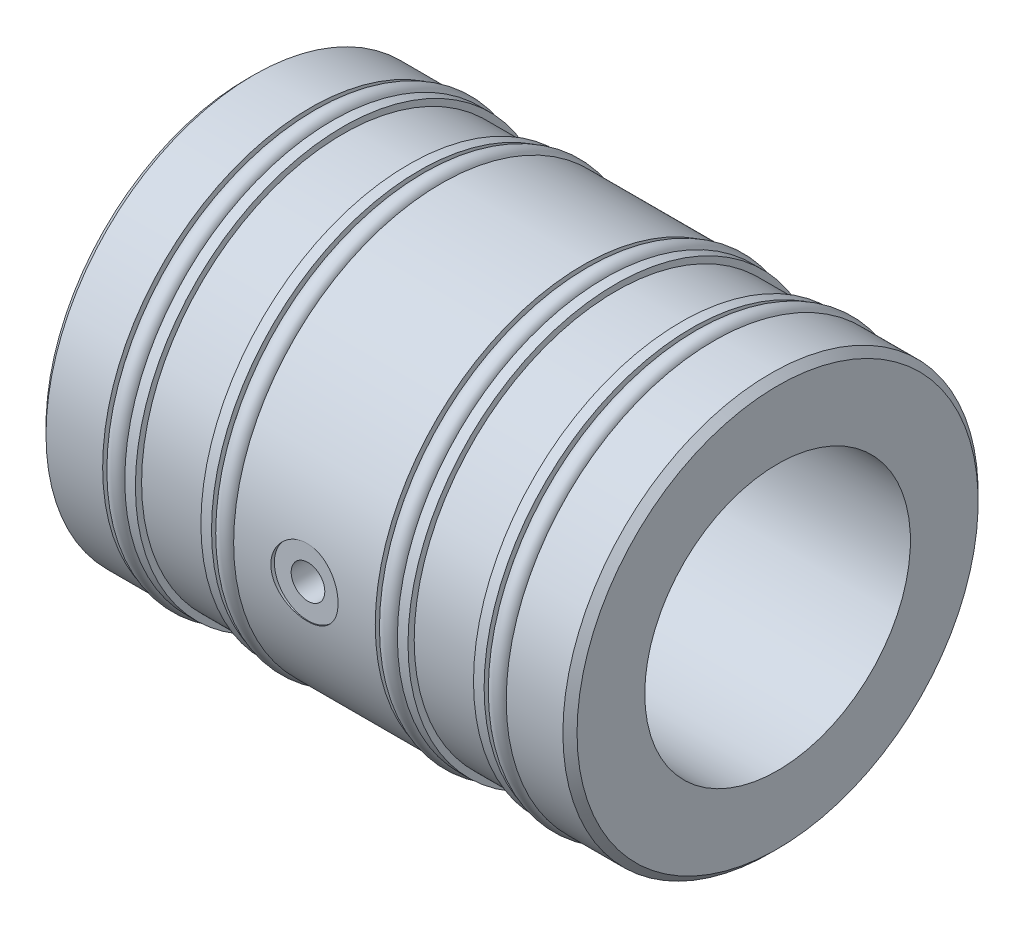
ISO-10303-21;
HEADER;
FILE_DESCRIPTION(('STEP AP214'),'2;1');
FILE_NAME('part.step','',(''),(''),'','','');
FILE_SCHEMA(('AUTOMOTIVE_DESIGN { 1 0 10303 214 1 1 1 1 }'));
ENDSEC;
DATA;
#1=APPLICATION_CONTEXT('core data for automotive mechanical design processes');
#2=APPLICATION_PROTOCOL_DEFINITION('international standard','automotive_design',2000,#1);
#3=PRODUCT_CONTEXT('',#1,'mechanical');
#4=PRODUCT('Part','Part','',(#3));
#5=PRODUCT_RELATED_PRODUCT_CATEGORY('part','',(#4));
#6=PRODUCT_DEFINITION_FORMATION('','',#4);
#7=PRODUCT_DEFINITION_CONTEXT('part definition',#1,'design');
#8=PRODUCT_DEFINITION('design','',#6,#7);
#9=PRODUCT_DEFINITION_SHAPE('','',#8);
#10=(LENGTH_UNIT() NAMED_UNIT(*) SI_UNIT(.MILLI.,.METRE.));
#11=(NAMED_UNIT(*) PLANE_ANGLE_UNIT() SI_UNIT($,.RADIAN.));
#12=(NAMED_UNIT(*) SI_UNIT($,.STERADIAN.) SOLID_ANGLE_UNIT());
#13=UNCERTAINTY_MEASURE_WITH_UNIT(LENGTH_MEASURE(1.E-05),#10,'distance_accuracy_value','');
#14=(GEOMETRIC_REPRESENTATION_CONTEXT(3) GLOBAL_UNCERTAINTY_ASSIGNED_CONTEXT((#13)) GLOBAL_UNIT_ASSIGNED_CONTEXT((#10,
#11,#12)) REPRESENTATION_CONTEXT('',''));
#15=CARTESIAN_POINT('',(0.,0.,0.));
#16=DIRECTION('',(0.,0.,1.));
#17=DIRECTION('',(1.,0.,0.));
#18=AXIS2_PLACEMENT_3D('',#15,#16,#17);
#19=CARTESIAN_POINT('',(0.,0.,0.));
#20=DIRECTION('',(-1.,0.,0.));
#21=DIRECTION('',(0.,0.,1.));
#22=AXIS2_PLACEMENT_3D('',#19,#20,#21);
#23=CYLINDRICAL_SURFACE('',#22,27.813);
#24=CARTESIAN_POINT('',(63.881,0.,0.));
#25=DIRECTION('',(-1.,0.,0.));
#26=DIRECTION('',(0.,0.,1.));
#27=AXIS2_PLACEMENT_3D('',#24,#25,#26);
#28=CIRCLE('',#27,27.813);
#29=CARTESIAN_POINT('',(63.881,0.,27.813));
#30=VERTEX_POINT('',#29);
#31=EDGE_CURVE('E93',#30,#30,#28,.T.);
#32=ORIENTED_EDGE('',*,*,#31,.F.);
#33=EDGE_LOOP('',(#32));
#34=FACE_BOUND('',#33,.T.);
#35=CARTESIAN_POINT('',(64.7887236764935,0.,0.));
#36=DIRECTION('',(1.,0.,0.));
#37=DIRECTION('',(0.,0.,-1.));
#38=AXIS2_PLACEMENT_3D('',#35,#36,#37);
#39=CIRCLE('',#38,27.813);
#40=CARTESIAN_POINT('',(64.7887236764935,0.,-27.813));
#41=VERTEX_POINT('',#40);
#42=EDGE_CURVE('E12',#41,#41,#39,.T.);
#43=ORIENTED_EDGE('',*,*,#42,.F.);
#44=EDGE_LOOP('',(#43));
#45=FACE_BOUND('',#44,.T.);
#46=ADVANCED_FACE('F36',(#34,#45),#23,.T.);
#47=CARTESIAN_POINT('',(67.056,0.,0.));
#48=DIRECTION('',(-1.,0.,0.));
#49=DIRECTION('',(0.,0.,1.));
#50=AXIS2_PLACEMENT_3D('',#47,#48,#49);
#51=CIRCLE('',#50,27.813);
#52=CARTESIAN_POINT('',(67.056,0.,27.813));
#53=VERTEX_POINT('',#52);
#54=EDGE_CURVE('E90',#53,#53,#51,.T.);
#55=ORIENTED_EDGE('',*,*,#54,.T.);
#56=EDGE_LOOP('',(#55));
#57=FACE_BOUND('',#56,.T.);
#58=CARTESIAN_POINT('',(66.1482763235065,0.,0.));
#59=DIRECTION('',(-1.,0.,0.));
#60=DIRECTION('',(0.,0.,1.));
#61=AXIS2_PLACEMENT_3D('',#58,#59,#60);
#62=CIRCLE('',#61,27.813);
#63=CARTESIAN_POINT('',(66.1482763235065,0.,27.813));
#64=VERTEX_POINT('',#63);
#65=EDGE_CURVE('E44',#64,#64,#62,.T.);
#66=ORIENTED_EDGE('',*,*,#65,.F.);
#67=EDGE_LOOP('',(#66));
#68=FACE_BOUND('',#67,.T.);
#69=ADVANCED_FACE('F210',(#57,#68),#23,.T.);
#70=CARTESIAN_POINT('',(0.,0.,0.));
#71=DIRECTION('',(-1.,0.,0.));
#72=DIRECTION('',(0.,0.,1.));
#73=AXIS2_PLACEMENT_3D('',#70,#71,#72);
#74=CYLINDRICAL_SURFACE('',#73,27.813);
#75=CARTESIAN_POINT('',(48.26,0.,0.));
#76=DIRECTION('',(-1.,0.,0.));
#77=DIRECTION('',(0.,0.,1.));
#78=AXIS2_PLACEMENT_3D('',#75,#76,#77);
#79=CIRCLE('',#78,27.813);
#80=CARTESIAN_POINT('',(48.26,0.,27.813));
#81=VERTEX_POINT('',#80);
#82=EDGE_CURVE('E117',#81,#81,#79,.T.);
#83=ORIENTED_EDGE('',*,*,#82,.F.);
#84=EDGE_LOOP('',(#83));
#85=FACE_BOUND('',#84,.T.);
#86=CARTESIAN_POINT('',(49.1677236764935,0.,0.));
#87=DIRECTION('',(1.,0.,0.));
#88=DIRECTION('',(0.,0.,-1.));
#89=AXIS2_PLACEMENT_3D('',#86,#87,#88);
#90=CIRCLE('',#89,27.813);
#91=CARTESIAN_POINT('',(49.1677236764935,0.,-27.813));
#92=VERTEX_POINT('',#91);
#93=EDGE_CURVE('E257',#92,#92,#90,.T.);
#94=ORIENTED_EDGE('',*,*,#93,.F.);
#95=EDGE_LOOP('',(#94));
#96=FACE_BOUND('',#95,.T.);
#97=ADVANCED_FACE('F240',(#85,#96),#74,.T.);
#98=CARTESIAN_POINT('',(51.435,0.,0.));
#99=DIRECTION('',(-1.,0.,0.));
#100=DIRECTION('',(0.,0.,1.));
#101=AXIS2_PLACEMENT_3D('',#98,#99,#100);
#102=CIRCLE('',#101,27.813);
#103=CARTESIAN_POINT('',(51.435,0.,27.813));
#104=VERTEX_POINT('',#103);
#105=EDGE_CURVE('E114',#104,#104,#102,.T.);
#106=ORIENTED_EDGE('',*,*,#105,.T.);
#107=EDGE_LOOP('',(#106));
#108=FACE_BOUND('',#107,.T.);
#109=CARTESIAN_POINT('',(50.5272763235065,0.,0.));
#110=DIRECTION('',(-1.,0.,0.));
#111=DIRECTION('',(0.,0.,1.));
#112=AXIS2_PLACEMENT_3D('',#109,#110,#111);
#113=CIRCLE('',#112,27.813);
#114=CARTESIAN_POINT('',(50.5272763235065,0.,27.813));
#115=VERTEX_POINT('',#114);
#116=EDGE_CURVE('E259',#115,#115,#113,.T.);
#117=ORIENTED_EDGE('',*,*,#116,.F.);
#118=EDGE_LOOP('',(#117));
#119=FACE_BOUND('',#118,.T.);
#120=ADVANCED_FACE('F242',(#108,#119),#74,.T.);
#121=CARTESIAN_POINT('',(0.,0.,0.));
#122=DIRECTION('',(-1.,0.,0.));
#123=DIRECTION('',(0.,0.,1.));
#124=AXIS2_PLACEMENT_3D('',#121,#122,#123);
#125=CYLINDRICAL_SURFACE('',#124,27.813);
#126=CARTESIAN_POINT('',(24.765,0.,0.));
#127=DIRECTION('',(-1.,0.,0.));
#128=DIRECTION('',(0.,0.,1.));
#129=AXIS2_PLACEMENT_3D('',#126,#127,#128);
#130=CIRCLE('',#129,27.813);
#131=CARTESIAN_POINT('',(24.765,0.,27.813));
#132=VERTEX_POINT('',#131);
#133=EDGE_CURVE('E129',#132,#132,#130,.T.);
#134=ORIENTED_EDGE('',*,*,#133,.F.);
#135=EDGE_LOOP('',(#134));
#136=FACE_BOUND('',#135,.T.);
#137=CARTESIAN_POINT('',(25.6727236764935,0.,0.));
#138=DIRECTION('',(1.,0.,0.));
#139=DIRECTION('',(0.,0.,-1.));
#140=AXIS2_PLACEMENT_3D('',#137,#138,#139);
#141=CIRCLE('',#140,27.813);
#142=CARTESIAN_POINT('',(25.6727236764935,0.,-27.813));
#143=VERTEX_POINT('',#142);
#144=EDGE_CURVE('E263',#143,#143,#141,.T.);
#145=ORIENTED_EDGE('',*,*,#144,.F.);
#146=EDGE_LOOP('',(#145));
#147=FACE_BOUND('',#146,.T.);
#148=ADVANCED_FACE('F292',(#136,#147),#125,.T.);
#149=CARTESIAN_POINT('',(27.94,0.,0.));
#150=DIRECTION('',(-1.,0.,0.));
#151=DIRECTION('',(0.,0.,1.));
#152=AXIS2_PLACEMENT_3D('',#149,#150,#151);
#153=CIRCLE('',#152,27.813);
#154=CARTESIAN_POINT('',(27.94,0.,27.813));
#155=VERTEX_POINT('',#154);
#156=EDGE_CURVE('E126',#155,#155,#153,.T.);
#157=ORIENTED_EDGE('',*,*,#156,.T.);
#158=EDGE_LOOP('',(#157));
#159=FACE_BOUND('',#158,.T.);
#160=CARTESIAN_POINT('',(27.0322763235065,0.,0.));
#161=DIRECTION('',(-1.,0.,0.));
#162=DIRECTION('',(0.,0.,1.));
#163=AXIS2_PLACEMENT_3D('',#160,#161,#162);
#164=CIRCLE('',#163,27.813);
#165=CARTESIAN_POINT('',(27.0322763235065,0.,27.813));
#166=VERTEX_POINT('',#165);
#167=EDGE_CURVE('E268',#166,#166,#164,.T.);
#168=ORIENTED_EDGE('',*,*,#167,.F.);
#169=EDGE_LOOP('',(#168));
#170=FACE_BOUND('',#169,.T.);
#171=ADVANCED_FACE('F294',(#159,#170),#125,.T.);
#172=CARTESIAN_POINT('',(0.,0.,0.));
#173=DIRECTION('',(-1.,0.,0.));
#174=DIRECTION('',(0.,0.,1.));
#175=AXIS2_PLACEMENT_3D('',#172,#173,#174);
#176=CYLINDRICAL_SURFACE('',#175,27.813);
#177=CARTESIAN_POINT('',(9.144,0.,0.));
#178=DIRECTION('',(-1.,0.,0.));
#179=DIRECTION('',(0.,0.,1.));
#180=AXIS2_PLACEMENT_3D('',#177,#178,#179);
#181=CIRCLE('',#180,27.813);
#182=CARTESIAN_POINT('',(9.144,0.,27.813));
#183=VERTEX_POINT('',#182);
#184=EDGE_CURVE('E153',#183,#183,#181,.T.);
#185=ORIENTED_EDGE('',*,*,#184,.F.);
#186=EDGE_LOOP('',(#185));
#187=FACE_BOUND('',#186,.T.);
#188=CARTESIAN_POINT('',(10.0517236764935,0.,0.));
#189=DIRECTION('',(1.,0.,0.));
#190=DIRECTION('',(0.,0.,-1.));
#191=AXIS2_PLACEMENT_3D('',#188,#189,#190);
#192=CIRCLE('',#191,27.813);
#193=CARTESIAN_POINT('',(10.0517236764935,0.,-27.813));
#194=VERTEX_POINT('',#193);
#195=EDGE_CURVE('E270',#194,#194,#192,.T.);
#196=ORIENTED_EDGE('',*,*,#195,.F.);
#197=EDGE_LOOP('',(#196));
#198=FACE_BOUND('',#197,.T.);
#199=ADVANCED_FACE('F321',(#187,#198),#176,.T.);
#200=CARTESIAN_POINT('',(12.319,0.,0.));
#201=DIRECTION('',(-1.,0.,0.));
#202=DIRECTION('',(0.,0.,1.));
#203=AXIS2_PLACEMENT_3D('',#200,#201,#202);
#204=CIRCLE('',#203,27.813);
#205=CARTESIAN_POINT('',(12.319,0.,27.813));
#206=VERTEX_POINT('',#205);
#207=EDGE_CURVE('E150',#206,#206,#204,.T.);
#208=ORIENTED_EDGE('',*,*,#207,.T.);
#209=EDGE_LOOP('',(#208));
#210=FACE_BOUND('',#209,.T.);
#211=CARTESIAN_POINT('',(11.4112763235065,0.,0.));
#212=DIRECTION('',(-1.,0.,0.));
#213=DIRECTION('',(0.,0.,1.));
#214=AXIS2_PLACEMENT_3D('',#211,#212,#213);
#215=CIRCLE('',#214,27.813);
#216=CARTESIAN_POINT('',(11.4112763235065,0.,27.813));
#217=VERTEX_POINT('',#216);
#218=EDGE_CURVE('E176',#217,#217,#215,.T.);
#219=ORIENTED_EDGE('',*,*,#218,.F.);
#220=EDGE_LOOP('',(#219));
#221=FACE_BOUND('',#220,.T.);
#222=ADVANCED_FACE('F324',(#210,#221),#176,.T.);
#223=CARTESIAN_POINT('',(0.,19.06016,0.));
#224=DIRECTION('',(1.,0.,0.));
#225=DIRECTION('',(0.,0.,-1.));
#226=AXIS2_PLACEMENT_3D('',#223,#224,#225);
#227=PLANE('',#226);
#228=CARTESIAN_POINT('',(0.,0.,0.));
#229=DIRECTION('',(1.,0.,0.));
#230=DIRECTION('',(0.,0.,-1.));
#231=AXIS2_PLACEMENT_3D('',#228,#229,#230);
#232=CIRCLE('',#231,28.7782);
#233=CARTESIAN_POINT('',(0.,0.,-28.7782));
#234=VERTEX_POINT('',#233);
#235=EDGE_CURVE('E159',#234,#234,#232,.F.);
#236=ORIENTED_EDGE('',*,*,#235,.T.);
#237=EDGE_LOOP('',(#236));
#238=FACE_BOUND('',#237,.T.);
#239=CARTESIAN_POINT('',(0.,0.,0.));
#240=DIRECTION('',(-1.,0.,0.));
#241=DIRECTION('',(0.,0.,1.));
#242=AXIS2_PLACEMENT_3D('',#239,#240,#241);
#243=CIRCLE('',#242,19.06016);
#244=CARTESIAN_POINT('',(0.,0.,19.06016));
#245=VERTEX_POINT('',#244);
#246=EDGE_CURVE('E81',#245,#245,#243,.T.);
#247=ORIENTED_EDGE('',*,*,#246,.F.);
#248=EDGE_LOOP('',(#247));
#249=FACE_BOUND('',#248,.T.);
#250=ADVANCED_FACE('F332',(#238,#249),#227,.F.);
#251=CARTESIAN_POINT('',(0.,0.,0.));
#252=DIRECTION('',(-1.,0.,0.));
#253=DIRECTION('',(0.,0.,1.));
#254=AXIS2_PLACEMENT_3D('',#251,#252,#253);
#255=CYLINDRICAL_SURFACE('',#254,29.7942);
#256=CARTESIAN_POINT('',(1.016,0.,0.));
#257=DIRECTION('',(1.,0.,0.));
#258=DIRECTION('',(0.,0.,-1.));
#259=AXIS2_PLACEMENT_3D('',#256,#257,#258);
#260=CIRCLE('',#259,29.7942);
#261=CARTESIAN_POINT('',(1.016,0.,-29.7942));
#262=VERTEX_POINT('',#261);
#263=EDGE_CURVE('E162',#262,#262,#260,.T.);
#264=ORIENTED_EDGE('',*,*,#263,.T.);
#265=EDGE_LOOP('',(#264));
#266=FACE_BOUND('',#265,.T.);
#267=CARTESIAN_POINT('',(9.144,0.,0.));
#268=DIRECTION('',(-1.,0.,0.));
#269=DIRECTION('',(0.,0.,1.));
#270=AXIS2_PLACEMENT_3D('',#267,#268,#269);
#271=CIRCLE('',#270,29.7942);
#272=CARTESIAN_POINT('',(9.144,0.,29.7942));
#273=VERTEX_POINT('',#272);
#274=EDGE_CURVE('E156',#273,#273,#271,.T.);
#275=ORIENTED_EDGE('',*,*,#274,.T.);
#276=EDGE_LOOP('',(#275));
#277=FACE_BOUND('',#276,.T.);
#278=ADVANCED_FACE('F328',(#266,#277),#255,.T.);
#279=CARTESIAN_POINT('',(9.144,29.7942,0.));
#280=DIRECTION('',(-1.,0.,0.));
#281=DIRECTION('',(0.,0.,1.));
#282=AXIS2_PLACEMENT_3D('',#279,#280,#281);
#283=PLANE('',#282);
#284=ORIENTED_EDGE('',*,*,#274,.F.);
#285=EDGE_LOOP('',(#284));
#286=FACE_BOUND('',#285,.T.);
#287=ORIENTED_EDGE('',*,*,#184,.T.);
#288=EDGE_LOOP('',(#287));
#289=FACE_BOUND('',#288,.T.);
#290=ADVANCED_FACE('F319',(#286,#289),#283,.F.);
#291=CARTESIAN_POINT('',(12.319,27.813,0.));
#292=DIRECTION('',(1.,0.,0.));
#293=DIRECTION('',(0.,0.,-1.));
#294=AXIS2_PLACEMENT_3D('',#291,#292,#293);
#295=PLANE('',#294);
#296=ORIENTED_EDGE('',*,*,#207,.F.);
#297=EDGE_LOOP('',(#296));
#298=FACE_BOUND('',#297,.T.);
#299=CARTESIAN_POINT('',(12.319,0.,0.));
#300=DIRECTION('',(-1.,0.,0.));
#301=DIRECTION('',(0.,0.,1.));
#302=AXIS2_PLACEMENT_3D('',#299,#300,#301);
#303=CIRCLE('',#302,29.7942);
#304=CARTESIAN_POINT('',(12.319,0.,29.7942));
#305=VERTEX_POINT('',#304);
#306=EDGE_CURVE('E147',#305,#305,#303,.T.);
#307=ORIENTED_EDGE('',*,*,#306,.T.);
#308=EDGE_LOOP('',(#307));
#309=FACE_BOUND('',#308,.T.);
#310=ADVANCED_FACE('F315',(#298,#309),#295,.F.);
#311=CARTESIAN_POINT('',(0.,0.,0.));
#312=DIRECTION('',(-1.,0.,0.));
#313=DIRECTION('',(0.,0.,1.));
#314=AXIS2_PLACEMENT_3D('',#311,#312,#313);
#315=CYLINDRICAL_SURFACE('',#314,29.7942);
#316=ORIENTED_EDGE('',*,*,#306,.F.);
#317=EDGE_LOOP('',(#316));
#318=FACE_BOUND('',#317,.T.);
#319=CARTESIAN_POINT('',(13.843,0.,0.));
#320=DIRECTION('',(-1.,0.,0.));
#321=DIRECTION('',(0.,0.,1.));
#322=AXIS2_PLACEMENT_3D('',#319,#320,#321);
#323=CIRCLE('',#322,29.7942);
#324=CARTESIAN_POINT('',(13.843,0.,29.7942));
#325=VERTEX_POINT('',#324);
#326=EDGE_CURVE('E144',#325,#325,#323,.T.);
#327=ORIENTED_EDGE('',*,*,#326,.T.);
#328=EDGE_LOOP('',(#327));
#329=FACE_BOUND('',#328,.T.);
#330=ADVANCED_FACE('F311',(#318,#329),#315,.T.);
#331=CARTESIAN_POINT('',(13.843,29.7942,0.));
#332=DIRECTION('',(-1.,0.,0.));
#333=DIRECTION('',(0.,0.,1.));
#334=AXIS2_PLACEMENT_3D('',#331,#332,#333);
#335=PLANE('',#334);
#336=ORIENTED_EDGE('',*,*,#326,.F.);
#337=EDGE_LOOP('',(#336));
#338=FACE_BOUND('',#337,.T.);
#339=CARTESIAN_POINT('',(13.843,0.,0.));
#340=DIRECTION('',(-1.,0.,0.));
#341=DIRECTION('',(0.,0.,1.));
#342=AXIS2_PLACEMENT_3D('',#339,#340,#341);
#343=CIRCLE('',#342,28.9052);
#344=CARTESIAN_POINT('',(13.843,0.,28.9052));
#345=VERTEX_POINT('',#344);
#346=EDGE_CURVE('E141',#345,#345,#343,.T.);
#347=ORIENTED_EDGE('',*,*,#346,.T.);
#348=EDGE_LOOP('',(#347));
#349=FACE_BOUND('',#348,.T.);
#350=ADVANCED_FACE('F307',(#338,#349),#335,.F.);
#351=CARTESIAN_POINT('',(0.,0.,0.));
#352=DIRECTION('',(-1.,0.,0.));
#353=DIRECTION('',(0.,0.,1.));
#354=AXIS2_PLACEMENT_3D('',#351,#352,#353);
#355=CYLINDRICAL_SURFACE('',#354,28.9052);
#356=ORIENTED_EDGE('',*,*,#346,.F.);
#357=EDGE_LOOP('',(#356));
#358=FACE_BOUND('',#357,.T.);
#359=CARTESIAN_POINT('',(23.241,0.,0.));
#360=DIRECTION('',(-1.,0.,0.));
#361=DIRECTION('',(0.,0.,1.));
#362=AXIS2_PLACEMENT_3D('',#359,#360,#361);
#363=CIRCLE('',#362,28.9052);
#364=CARTESIAN_POINT('',(23.241,0.,28.9052));
#365=VERTEX_POINT('',#364);
#366=EDGE_CURVE('E138',#365,#365,#363,.T.);
#367=ORIENTED_EDGE('',*,*,#366,.T.);
#368=EDGE_LOOP('',(#367));
#369=FACE_BOUND('',#368,.T.);
#370=ADVANCED_FACE('F303',(#358,#369),#355,.T.);
#371=CARTESIAN_POINT('',(23.241,28.9052,0.));
#372=DIRECTION('',(1.,0.,0.));
#373=DIRECTION('',(0.,0.,-1.));
#374=AXIS2_PLACEMENT_3D('',#371,#372,#373);
#375=PLANE('',#374);
#376=ORIENTED_EDGE('',*,*,#366,.F.);
#377=EDGE_LOOP('',(#376));
#378=FACE_BOUND('',#377,.T.);
#379=CARTESIAN_POINT('',(23.241,0.,0.));
#380=DIRECTION('',(-1.,0.,0.));
#381=DIRECTION('',(0.,0.,1.));
#382=AXIS2_PLACEMENT_3D('',#379,#380,#381);
#383=CIRCLE('',#382,29.7942);
#384=CARTESIAN_POINT('',(23.241,0.,29.7942));
#385=VERTEX_POINT('',#384);
#386=EDGE_CURVE('E135',#385,#385,#383,.T.);
#387=ORIENTED_EDGE('',*,*,#386,.T.);
#388=EDGE_LOOP('',(#387));
#389=FACE_BOUND('',#388,.T.);
#390=ADVANCED_FACE('F299',(#378,#389),#375,.F.);
#391=CARTESIAN_POINT('',(0.,0.,0.));
#392=DIRECTION('',(-1.,0.,0.));
#393=DIRECTION('',(0.,0.,1.));
#394=AXIS2_PLACEMENT_3D('',#391,#392,#393);
#395=CYLINDRICAL_SURFACE('',#394,29.7942);
#396=ORIENTED_EDGE('',*,*,#386,.F.);
#397=EDGE_LOOP('',(#396));
#398=FACE_BOUND('',#397,.T.);
#399=CARTESIAN_POINT('',(24.765,0.,0.));
#400=DIRECTION('',(-1.,0.,0.));
#401=DIRECTION('',(0.,0.,1.));
#402=AXIS2_PLACEMENT_3D('',#399,#400,#401);
#403=CIRCLE('',#402,29.7942);
#404=CARTESIAN_POINT('',(24.765,0.,29.7942));
#405=VERTEX_POINT('',#404);
#406=EDGE_CURVE('E132',#405,#405,#403,.T.);
#407=ORIENTED_EDGE('',*,*,#406,.T.);
#408=EDGE_LOOP('',(#407));
#409=FACE_BOUND('',#408,.T.);
#410=ADVANCED_FACE('F287',(#398,#409),#395,.T.);
#411=CARTESIAN_POINT('',(24.765,29.7942,0.));
#412=DIRECTION('',(-1.,0.,0.));
#413=DIRECTION('',(0.,0.,1.));
#414=AXIS2_PLACEMENT_3D('',#411,#412,#413);
#415=PLANE('',#414);
#416=ORIENTED_EDGE('',*,*,#406,.F.);
#417=EDGE_LOOP('',(#416));
#418=FACE_BOUND('',#417,.T.);
#419=ORIENTED_EDGE('',*,*,#133,.T.);
#420=EDGE_LOOP('',(#419));
#421=FACE_BOUND('',#420,.T.);
#422=ADVANCED_FACE('F282',(#418,#421),#415,.F.);
#423=CARTESIAN_POINT('',(27.94,27.813,0.));
#424=DIRECTION('',(1.,0.,0.));
#425=DIRECTION('',(0.,0.,-1.));
#426=AXIS2_PLACEMENT_3D('',#423,#424,#425);
#427=PLANE('',#426);
#428=ORIENTED_EDGE('',*,*,#156,.F.);
#429=EDGE_LOOP('',(#428));
#430=FACE_BOUND('',#429,.T.);
#431=CARTESIAN_POINT('',(27.94,0.,0.));
#432=DIRECTION('',(-1.,0.,0.));
#433=DIRECTION('',(0.,0.,1.));
#434=AXIS2_PLACEMENT_3D('',#431,#432,#433);
#435=CIRCLE('',#434,29.7942);
#436=CARTESIAN_POINT('',(27.94,0.,29.7942));
#437=VERTEX_POINT('',#436);
#438=EDGE_CURVE('E123',#437,#437,#435,.T.);
#439=ORIENTED_EDGE('',*,*,#438,.T.);
#440=EDGE_LOOP('',(#439));
#441=FACE_BOUND('',#440,.T.);
#442=ADVANCED_FACE('F249',(#430,#441),#427,.F.);
#443=CARTESIAN_POINT('',(0.,0.,0.));
#444=DIRECTION('',(-1.,0.,0.));
#445=DIRECTION('',(0.,0.,1.));
#446=AXIS2_PLACEMENT_3D('',#443,#444,#445);
#447=CYLINDRICAL_SURFACE('',#446,29.7942);
#448=CARTESIAN_POINT('',(42.926,0.,29.7942));
#449=CARTESIAN_POINT('',(42.9260020035738,-0.134639986539971,29.7942008494683));
#450=CARTESIAN_POINT('',(42.9203637620157,-0.269252577115379,29.7932856376008));
#451=CARTESIAN_POINT('',(42.8978567054179,-0.537555353537,29.7896521509695));
#452=CARTESIAN_POINT('',(42.8809854093729,-0.67124532901627,29.786933477882));
#453=CARTESIAN_POINT('',(42.8361229302062,-0.936782302700477,29.7797657904965));
#454=CARTESIAN_POINT('',(42.8081246794864,-1.06862807430041,29.7753156764629));
#455=CARTESIAN_POINT('',(42.7412099700091,-1.32950570293145,29.7648083488421));
#456=CARTESIAN_POINT('',(42.7022895053653,-1.45853650878325,29.758750545655));
#457=CARTESIAN_POINT('',(42.6138786945886,-1.71267483294373,29.7452059043406));
#458=CARTESIAN_POINT('',(42.5644008650695,-1.83778679766163,29.7377207595504));
#459=CARTESIAN_POINT('',(42.4551913439396,-2.08342440161099,29.7215217288506));
#460=CARTESIAN_POINT('',(42.3954558738152,-2.20394833073154,29.7128073903663));
#461=CARTESIAN_POINT('',(42.2662062527555,-2.43947476652538,29.6943978671088));
#462=CARTESIAN_POINT('',(42.1966970309948,-2.55448001744711,29.684703177442));
#463=CARTESIAN_POINT('',(42.0483398318724,-2.77829467100706,29.6645927635067));
#464=CARTESIAN_POINT('',(41.9694883841792,-2.88710174886165,29.6541767718989));
#465=CARTESIAN_POINT('',(41.802369121458,-3.0985543545651,29.6328313856766));
#466=CARTESIAN_POINT('',(41.7140331946687,-3.20114571874944,29.6218986433447));
#467=CARTESIAN_POINT('',(41.5290320508027,-3.39857669593582,29.5998969948601));
#468=CARTESIAN_POINT('',(41.4323637625154,-3.49341342535622,29.5888280398006));
#469=CARTESIAN_POINT('',(41.2314205091255,-3.67461258548655,29.5668717508506));
#470=CARTESIAN_POINT('',(41.12714787804,-3.76097759751197,29.5559843624815));
#471=CARTESIAN_POINT('',(40.9116479875274,-3.92469523219081,29.5346904324286));
#472=CARTESIAN_POINT('',(40.8004181772446,-4.00204451910218,29.5242840695741));
#473=CARTESIAN_POINT('',(40.5711663902381,-4.14754550042536,29.5041971688664));
#474=CARTESIAN_POINT('',(40.4531107476666,-4.21564485622637,29.4945208886886));
#475=CARTESIAN_POINT('',(40.2115922296375,-4.34166379484051,29.476233585027));
#476=CARTESIAN_POINT('',(40.0881273567111,-4.39957957690142,29.4676229596245));
#477=CARTESIAN_POINT('',(39.7110045155279,-4.55730066751341,29.4437909814044));
#478=CARTESIAN_POINT('',(39.4503506037742,-4.64124940465327,29.4305451788465));
#479=CARTESIAN_POINT('',(38.9208204083884,-4.76338371774704,29.4110242277545));
#480=CARTESIAN_POINT('',(38.652035435496,-4.80196124305063,29.4046894121654));
#481=CARTESIAN_POINT('',(38.1117008343191,-4.83356185772845,29.399512047683));
#482=CARTESIAN_POINT('',(37.840151392085,-4.82658799276471,29.4006689978745));
#483=CARTESIAN_POINT('',(37.3048258965164,-4.76757885346421,29.4102940771794));
#484=CARTESIAN_POINT('',(37.0409999474448,-4.71598212538322,29.4186910500981));
#485=CARTESIAN_POINT('',(36.5257971612544,-4.56988598338109,29.4417376617684));
#486=CARTESIAN_POINT('',(36.2744207297278,-4.47538517270832,29.4563875040827));
#487=CARTESIAN_POINT('',(35.7899368293157,-4.24571379129083,29.4903668346544));
#488=CARTESIAN_POINT('',(35.5569177187718,-4.11036007058983,29.5097173187448));
#489=CARTESIAN_POINT('',(35.11673284835,-3.80295566602872,29.5509027986339));
#490=CARTESIAN_POINT('',(34.9095690636744,-3.63090218122861,29.5727379840064));
#491=CARTESIAN_POINT('',(34.5244365425371,-3.25258774442896,29.6167457434736));
#492=CARTESIAN_POINT('',(34.3468374985796,-3.04595033754099,29.638919277262));
#493=CARTESIAN_POINT('',(34.0287793484165,-2.60560982537006,29.6808690088614));
#494=CARTESIAN_POINT('',(33.8883204575397,-2.37190656317766,29.7006451927727));
#495=CARTESIAN_POINT('',(33.6485003840242,-1.88372863028595,29.7355978209295));
#496=CARTESIAN_POINT('',(33.5491706531315,-1.62923824091742,29.7507707426682));
#497=CARTESIAN_POINT('',(33.3947652476296,-1.10688701077145,29.7747786725913));
#498=CARTESIAN_POINT('',(33.3396860786998,-0.839027227505435,29.7836141812145));
#499=CARTESIAN_POINT('',(33.2758436616775,-0.300728413624641,29.7938847663008));
#500=CARTESIAN_POINT('',(33.2665726884052,-0.0303510922100047,29.7954009636045));
#501=CARTESIAN_POINT('',(33.2932579577961,0.508094569831006,29.79108387759));
#502=CARTESIAN_POINT('',(33.3292125599555,0.776162993854752,29.7852508608558));
#503=CARTESIAN_POINT('',(33.4449060639689,1.30082196633725,29.7669409519457));
#504=CARTESIAN_POINT('',(33.5243947670412,1.55746912621777,29.7545020373985));
#505=CARTESIAN_POINT('',(33.7246342679223,2.05379419624302,29.7243697726462));
#506=CARTESIAN_POINT('',(33.8453872749596,2.29347119700147,29.7066761411183));
#507=CARTESIAN_POINT('',(34.1258984795884,2.75126575521272,29.6677968962713));
#508=CARTESIAN_POINT('',(34.2859752646181,2.96918567243389,29.6465832450644));
#509=CARTESIAN_POINT('',(34.6401512154747,3.37525031648075,29.6031049109253));
#510=CARTESIAN_POINT('',(34.834252707306,3.56339300599466,29.5808401562133));
#511=CARTESIAN_POINT('',(35.2532369159621,3.90643482007769,29.5375080206984));
#512=CARTESIAN_POINT('',(35.4784014878545,4.06099167490269,29.5164544423125));
#513=CARTESIAN_POINT('',(35.9518064372421,4.33008617980127,29.478182831484));
#514=CARTESIAN_POINT('',(36.2000461130357,4.44462504629688,29.4609646824619));
#515=CARTESIAN_POINT('',(36.7115277303934,4.62991947431136,29.4324140293253));
#516=CARTESIAN_POINT('',(36.9747057355253,4.70084822422095,29.421058273167));
#517=CARTESIAN_POINT('',(37.5095887617871,4.79743891865276,29.4054659831606));
#518=CARTESIAN_POINT('',(37.7812930847219,4.8231045598434,29.4012288679297));
#519=CARTESIAN_POINT('',(38.1873100300975,4.82708927399237,29.4005688385271));
#520=CARTESIAN_POINT('',(38.3216664217983,4.82278042464873,29.4012790954872));
#521=CARTESIAN_POINT('',(38.5895172982136,4.8029830121719,29.4045207273012));
#522=CARTESIAN_POINT('',(38.723012087435,4.78749864476661,29.4070514186914));
#523=CARTESIAN_POINT('',(38.9882395600859,4.7454559060398,29.4138648631123));
#524=CARTESIAN_POINT('',(39.1199715952475,4.71889357027546,29.4181482433626));
#525=CARTESIAN_POINT('',(39.3806588319949,4.65491054768396,29.4283402748149));
#526=CARTESIAN_POINT('',(39.5096150164351,4.61749377438764,29.4342483402022));
#527=CARTESIAN_POINT('',(39.763806943994,4.53210629664991,29.4475165204427));
#528=CARTESIAN_POINT('',(39.889045185689,4.48414287088438,29.4548756335085));
#529=CARTESIAN_POINT('',(40.1349867459467,4.37801735042629,29.4708363331302));
#530=CARTESIAN_POINT('',(40.2556916728205,4.31985891498354,29.479437473696));
#531=CARTESIAN_POINT('',(40.4918377733077,4.19372317127787,29.4976456579363));
#532=CARTESIAN_POINT('',(40.6072768767306,4.12574204438383,29.5072530924123));
#533=CARTESIAN_POINT('',(40.8320221256623,3.98048087171535,29.5271992604137));
#534=CARTESIAN_POINT('',(40.9413304134936,3.90320410422348,29.5375377355968));
#535=CARTESIAN_POINT('',(41.1543535076054,3.73891716510726,29.5587853134484));
#536=CARTESIAN_POINT('',(41.2579888477641,3.65180460824369,29.569699639088));
#537=CARTESIAN_POINT('',(41.4575331005105,3.46922605758577,29.5916757406331));
#538=CARTESIAN_POINT('',(41.553444764442,3.37376306390849,29.6027374623817));
#539=CARTESIAN_POINT('',(41.7369791560435,3.17505306070863,29.6247090631021));
#540=CARTESIAN_POINT('',(41.8245968988917,3.07180143619658,29.6356188474392));
#541=CARTESIAN_POINT('',(41.9908388057872,2.85831180304777,29.6569706687362));
#542=CARTESIAN_POINT('',(42.0694662781506,2.74807638772366,29.6674128768925));
#543=CARTESIAN_POINT('',(42.2177198683042,2.5205595921372,29.6876112578794));
#544=CARTESIAN_POINT('',(42.2872803421496,2.40323495748902,29.6973622171003));
#545=CARTESIAN_POINT('',(42.4162296853579,2.16310068653158,29.7158180828053));
#546=CARTESIAN_POINT('',(42.4756222841724,2.04029308223614,29.724523372477));
#547=CARTESIAN_POINT('',(42.5837887327704,1.79010382243682,29.7406384807609));
#548=CARTESIAN_POINT('',(42.6325700766348,1.66272546952446,29.7480492129067));
#549=CARTESIAN_POINT('',(42.7191866868379,1.40426852126871,29.7613698937813));
#550=CARTESIAN_POINT('',(42.7570243315938,1.27319073673772,29.7672801685734));
#551=CARTESIAN_POINT('',(42.8345882937164,0.954313496729125,29.7794956277145));
#552=CARTESIAN_POINT('',(42.8688276776129,0.765120243302676,29.7849843641846));
#553=CARTESIAN_POINT('',(42.9145319235151,0.383932738734874,29.7923359163215));
#554=CARTESIAN_POINT('',(42.9259971437682,0.191938531701591,29.7941987890246));
#555=CARTESIAN_POINT('',(42.926,0.,29.7942));
#556=B_SPLINE_CURVE_WITH_KNOTS('',3,(#448,#449,#450,#451,#452,#453,#454,#455,#456,#457,#458,
#459,#460,#461,#462,#463,#464,#465,#466,#467,#468,#469,#470,#471,#472,#473,#474,#475,#476,#477,
#478,#479,#480,#481,#482,#483,#484,#485,#486,#487,#488,#489,#490,#491,#492,#493,#494,#495,#496,
#497,#498,#499,#500,#501,#502,#503,#504,#505,#506,#507,#508,#509,#510,#511,#512,#513,#514,#515,
#516,#517,#518,#519,#520,#521,#522,#523,#524,#525,#526,#527,#528,#529,#530,#531,#532,#533,#534,
#535,#536,#537,#538,#539,#540,#541,#542,#543,#544,#545,#546,#547,#548,#549,#550,#551,#552,#553,
#554,#555),.UNSPECIFIED.,.T.,.F.,(4,2,2,2,2,2,2,2,2,2,2,2,2,2,2,2,2,2,2,2,2,2,2,2,2,2,2,2,2,2,2,
2,2,2,2,2,2,2,2,2,2,2,2,2,2,2,2,2,2,2,2,2,2,4),(0.,0.403751760612085,0.807592726055608,
1.21169061347381,1.61593690400905,2.0197065645628,2.42362527838072,2.82734101057616,
3.2312071829537,3.63819695762587,4.04533739073073,4.45235338107531,4.85951948905373,
5.26890117538269,5.67843532988309,6.49656213363075,7.307568206944,8.11852005523605,
8.92159141669111,9.7246889241818,10.5314417145752,11.3382560986936,12.154504328237,
12.97075729007,13.7876332983843,14.6044447943573,15.4121823508241,16.219890608419,
17.0230047962907,17.826161988422,18.6360540628976,19.4460015250022,20.2638516724871,
21.0816769577146,21.8962330825003,22.71072267886,23.1136120300472,23.5163501993996,
23.9192326194218,24.3219699616993,24.7244302259924,25.1267463316717,25.5292192631057,
25.9315506687506,26.3385428425853,26.7453893895376,27.1524789276266,27.5594181760086,
27.9691568774948,28.3787449683631,28.7880428462079,29.1972517035198,29.7728365736777,
30.3484123895651),.UNSPECIFIED.);
#557=CARTESIAN_POINT('',(33.274,0.,29.7942));
#558=VERTEX_POINT('',#557);
#559=CARTESIAN_POINT('',(42.926,0.,29.7942));
#560=VERTEX_POINT('',#559);
#561=EDGE_CURVE('E53',#558,#560,#556,.T.);
#562=ORIENTED_EDGE('',*,*,#561,.T.);
#563=EDGE_CURVE('E50',#560,#558,#556,.T.);
#564=ORIENTED_EDGE('',*,*,#563,.T.);
#565=EDGE_LOOP('',(#562,#564));
#566=FACE_BOUND('',#565,.T.);
#567=ORIENTED_EDGE('',*,*,#438,.F.);
#568=EDGE_LOOP('',(#567));
#569=FACE_BOUND('',#568,.T.);
#570=CARTESIAN_POINT('',(48.26,0.,0.));
#571=DIRECTION('',(-1.,0.,0.));
#572=DIRECTION('',(0.,0.,1.));
#573=AXIS2_PLACEMENT_3D('',#570,#571,#572);
#574=CIRCLE('',#573,29.7942);
#575=CARTESIAN_POINT('',(48.26,0.,29.7942));
#576=VERTEX_POINT('',#575);
#577=EDGE_CURVE('E120',#576,#576,#574,.T.);
#578=ORIENTED_EDGE('',*,*,#577,.T.);
#579=EDGE_LOOP('',(#578));
#580=FACE_BOUND('',#579,.T.);
#581=ADVANCED_FACE('F178',(#566,#569,#580),#447,.T.);
#582=CARTESIAN_POINT('',(48.26,29.7942,0.));
#583=DIRECTION('',(-1.,0.,0.));
#584=DIRECTION('',(0.,0.,1.));
#585=AXIS2_PLACEMENT_3D('',#582,#583,#584);
#586=PLANE('',#585);
#587=ORIENTED_EDGE('',*,*,#577,.F.);
#588=EDGE_LOOP('',(#587));
#589=FACE_BOUND('',#588,.T.);
#590=ORIENTED_EDGE('',*,*,#82,.T.);
#591=EDGE_LOOP('',(#590));
#592=FACE_BOUND('',#591,.T.);
#593=ADVANCED_FACE('F238',(#589,#592),#586,.F.);
#594=CARTESIAN_POINT('',(51.435,29.7942,0.));
#595=DIRECTION('',(1.,0.,0.));
#596=DIRECTION('',(0.,0.,-1.));
#597=AXIS2_PLACEMENT_3D('',#594,#595,#596);
#598=PLANE('',#597);
#599=ORIENTED_EDGE('',*,*,#105,.F.);
#600=EDGE_LOOP('',(#599));
#601=FACE_BOUND('',#600,.T.);
#602=CARTESIAN_POINT('',(51.435,0.,0.));
#603=DIRECTION('',(-1.,0.,0.));
#604=DIRECTION('',(0.,0.,1.));
#605=AXIS2_PLACEMENT_3D('',#602,#603,#604);
#606=CIRCLE('',#605,29.7942);
#607=CARTESIAN_POINT('',(51.435,0.,29.7942));
#608=VERTEX_POINT('',#607);
#609=EDGE_CURVE('E111',#608,#608,#606,.T.);
#610=ORIENTED_EDGE('',*,*,#609,.T.);
#611=EDGE_LOOP('',(#610));
#612=FACE_BOUND('',#611,.T.);
#613=ADVANCED_FACE('F234',(#601,#612),#598,.F.);
#614=CARTESIAN_POINT('',(0.,0.,0.));
#615=DIRECTION('',(-1.,0.,0.));
#616=DIRECTION('',(0.,0.,1.));
#617=AXIS2_PLACEMENT_3D('',#614,#615,#616);
#618=CYLINDRICAL_SURFACE('',#617,29.7942);
#619=ORIENTED_EDGE('',*,*,#609,.F.);
#620=EDGE_LOOP('',(#619));
#621=FACE_BOUND('',#620,.T.);
#622=CARTESIAN_POINT('',(52.959,0.,0.));
#623=DIRECTION('',(-1.,0.,0.));
#624=DIRECTION('',(0.,0.,1.));
#625=AXIS2_PLACEMENT_3D('',#622,#623,#624);
#626=CIRCLE('',#625,29.7942);
#627=CARTESIAN_POINT('',(52.959,0.,29.7942));
#628=VERTEX_POINT('',#627);
#629=EDGE_CURVE('E108',#628,#628,#626,.T.);
#630=ORIENTED_EDGE('',*,*,#629,.T.);
#631=EDGE_LOOP('',(#630));
#632=FACE_BOUND('',#631,.T.);
#633=ADVANCED_FACE('F230',(#621,#632),#618,.T.);
#634=CARTESIAN_POINT('',(52.959,28.9052,0.));
#635=DIRECTION('',(-1.,0.,0.));
#636=DIRECTION('',(0.,0.,1.));
#637=AXIS2_PLACEMENT_3D('',#634,#635,#636);
#638=PLANE('',#637);
#639=ORIENTED_EDGE('',*,*,#629,.F.);
#640=EDGE_LOOP('',(#639));
#641=FACE_BOUND('',#640,.T.);
#642=CARTESIAN_POINT('',(52.959,0.,0.));
#643=DIRECTION('',(-1.,0.,0.));
#644=DIRECTION('',(0.,0.,1.));
#645=AXIS2_PLACEMENT_3D('',#642,#643,#644);
#646=CIRCLE('',#645,28.9052);
#647=CARTESIAN_POINT('',(52.959,0.,28.9052));
#648=VERTEX_POINT('',#647);
#649=EDGE_CURVE('E105',#648,#648,#646,.T.);
#650=ORIENTED_EDGE('',*,*,#649,.T.);
#651=EDGE_LOOP('',(#650));
#652=FACE_BOUND('',#651,.T.);
#653=ADVANCED_FACE('F226',(#641,#652),#638,.F.);
#654=CARTESIAN_POINT('',(0.,0.,0.));
#655=DIRECTION('',(-1.,0.,0.));
#656=DIRECTION('',(0.,0.,1.));
#657=AXIS2_PLACEMENT_3D('',#654,#655,#656);
#658=CYLINDRICAL_SURFACE('',#657,28.9052);
#659=ORIENTED_EDGE('',*,*,#649,.F.);
#660=EDGE_LOOP('',(#659));
#661=FACE_BOUND('',#660,.T.);
#662=CARTESIAN_POINT('',(62.357,0.,0.));
#663=DIRECTION('',(-1.,0.,0.));
#664=DIRECTION('',(0.,0.,1.));
#665=AXIS2_PLACEMENT_3D('',#662,#663,#664);
#666=CIRCLE('',#665,28.9052);
#667=CARTESIAN_POINT('',(62.357,0.,28.9052));
#668=VERTEX_POINT('',#667);
#669=EDGE_CURVE('E102',#668,#668,#666,.T.);
#670=ORIENTED_EDGE('',*,*,#669,.T.);
#671=EDGE_LOOP('',(#670));
#672=FACE_BOUND('',#671,.T.);
#673=ADVANCED_FACE('F222',(#661,#672),#658,.T.);
#674=CARTESIAN_POINT('',(62.357,29.7942,0.));
#675=DIRECTION('',(1.,0.,0.));
#676=DIRECTION('',(0.,0.,-1.));
#677=AXIS2_PLACEMENT_3D('',#674,#675,#676);
#678=PLANE('',#677);
#679=ORIENTED_EDGE('',*,*,#669,.F.);
#680=EDGE_LOOP('',(#679));
#681=FACE_BOUND('',#680,.T.);
#682=CARTESIAN_POINT('',(62.357,0.,0.));
#683=DIRECTION('',(-1.,0.,0.));
#684=DIRECTION('',(0.,0.,1.));
#685=AXIS2_PLACEMENT_3D('',#682,#683,#684);
#686=CIRCLE('',#685,29.7942);
#687=CARTESIAN_POINT('',(62.357,0.,29.7942));
#688=VERTEX_POINT('',#687);
#689=EDGE_CURVE('E99',#688,#688,#686,.T.);
#690=ORIENTED_EDGE('',*,*,#689,.T.);
#691=EDGE_LOOP('',(#690));
#692=FACE_BOUND('',#691,.T.);
#693=ADVANCED_FACE('F218',(#681,#692),#678,.F.);
#694=CARTESIAN_POINT('',(0.,0.,0.));
#695=DIRECTION('',(-1.,0.,0.));
#696=DIRECTION('',(0.,0.,1.));
#697=AXIS2_PLACEMENT_3D('',#694,#695,#696);
#698=CYLINDRICAL_SURFACE('',#697,29.7942);
#699=ORIENTED_EDGE('',*,*,#689,.F.);
#700=EDGE_LOOP('',(#699));
#701=FACE_BOUND('',#700,.T.);
#702=CARTESIAN_POINT('',(63.881,0.,0.));
#703=DIRECTION('',(-1.,0.,0.));
#704=DIRECTION('',(0.,0.,1.));
#705=AXIS2_PLACEMENT_3D('',#702,#703,#704);
#706=CIRCLE('',#705,29.7942);
#707=CARTESIAN_POINT('',(63.881,0.,29.7942));
#708=VERTEX_POINT('',#707);
#709=EDGE_CURVE('E96',#708,#708,#706,.T.);
#710=ORIENTED_EDGE('',*,*,#709,.T.);
#711=EDGE_LOOP('',(#710));
#712=FACE_BOUND('',#711,.T.);
#713=ADVANCED_FACE('F214',(#701,#712),#698,.T.);
#714=CARTESIAN_POINT('',(63.881,27.813,0.));
#715=DIRECTION('',(-1.,0.,0.));
#716=DIRECTION('',(0.,0.,1.));
#717=AXIS2_PLACEMENT_3D('',#714,#715,#716);
#718=PLANE('',#717);
#719=ORIENTED_EDGE('',*,*,#709,.F.);
#720=EDGE_LOOP('',(#719));
#721=FACE_BOUND('',#720,.T.);
#722=ORIENTED_EDGE('',*,*,#31,.T.);
#723=EDGE_LOOP('',(#722));
#724=FACE_BOUND('',#723,.T.);
#725=ADVANCED_FACE('F206',(#721,#724),#718,.F.);
#726=CARTESIAN_POINT('',(67.056,29.7942,0.));
#727=DIRECTION('',(1.,0.,0.));
#728=DIRECTION('',(0.,0.,-1.));
#729=AXIS2_PLACEMENT_3D('',#726,#727,#728);
#730=PLANE('',#729);
#731=ORIENTED_EDGE('',*,*,#54,.F.);
#732=EDGE_LOOP('',(#731));
#733=FACE_BOUND('',#732,.T.);
#734=CARTESIAN_POINT('',(67.056,0.,0.));
#735=DIRECTION('',(-1.,0.,0.));
#736=DIRECTION('',(0.,0.,1.));
#737=AXIS2_PLACEMENT_3D('',#734,#735,#736);
#738=CIRCLE('',#737,29.7942);
#739=CARTESIAN_POINT('',(67.056,0.,29.7942));
#740=VERTEX_POINT('',#739);
#741=EDGE_CURVE('E87',#740,#740,#738,.T.);
#742=ORIENTED_EDGE('',*,*,#741,.T.);
#743=EDGE_LOOP('',(#742));
#744=FACE_BOUND('',#743,.T.);
#745=ADVANCED_FACE('F202',(#733,#744),#730,.F.);
#746=CARTESIAN_POINT('',(0.,0.,0.));
#747=DIRECTION('',(-1.,0.,0.));
#748=DIRECTION('',(0.,0.,1.));
#749=AXIS2_PLACEMENT_3D('',#746,#747,#748);
#750=CYLINDRICAL_SURFACE('',#749,29.7942);
#751=CARTESIAN_POINT('',(75.184,0.,0.));
#752=DIRECTION('',(-1.,0.,0.));
#753=DIRECTION('',(0.,0.,1.));
#754=AXIS2_PLACEMENT_3D('',#751,#752,#753);
#755=CIRCLE('',#754,29.7942);
#756=CARTESIAN_POINT('',(75.184,0.,29.7942));
#757=VERTEX_POINT('',#756);
#758=EDGE_CURVE('E165',#757,#757,#755,.T.);
#759=ORIENTED_EDGE('',*,*,#758,.T.);
#760=EDGE_LOOP('',(#759));
#761=FACE_BOUND('',#760,.T.);
#762=ORIENTED_EDGE('',*,*,#741,.F.);
#763=EDGE_LOOP('',(#762));
#764=FACE_BOUND('',#763,.T.);
#765=ADVANCED_FACE('F198',(#761,#764),#750,.T.);
#766=CARTESIAN_POINT('',(76.2,19.06016,0.));
#767=DIRECTION('',(-1.,0.,0.));
#768=DIRECTION('',(0.,0.,1.));
#769=AXIS2_PLACEMENT_3D('',#766,#767,#768);
#770=PLANE('',#769);
#771=CARTESIAN_POINT('',(76.2,0.,0.));
#772=DIRECTION('',(-1.,0.,0.));
#773=DIRECTION('',(0.,0.,1.));
#774=AXIS2_PLACEMENT_3D('',#771,#772,#773);
#775=CIRCLE('',#774,28.7782);
#776=CARTESIAN_POINT('',(76.2,0.,28.7782));
#777=VERTEX_POINT('',#776);
#778=EDGE_CURVE('E168',#777,#777,#775,.F.);
#779=ORIENTED_EDGE('',*,*,#778,.T.);
#780=EDGE_LOOP('',(#779));
#781=FACE_BOUND('',#780,.T.);
#782=CARTESIAN_POINT('',(76.2,0.,0.));
#783=DIRECTION('',(-1.,0.,0.));
#784=DIRECTION('',(0.,0.,1.));
#785=AXIS2_PLACEMENT_3D('',#782,#783,#784);
#786=CIRCLE('',#785,19.06016);
#787=CARTESIAN_POINT('',(76.2,0.,19.06016));
#788=VERTEX_POINT('',#787);
#789=EDGE_CURVE('E84',#788,#788,#786,.T.);
#790=ORIENTED_EDGE('',*,*,#789,.T.);
#791=EDGE_LOOP('',(#790));
#792=FACE_BOUND('',#791,.T.);
#793=ADVANCED_FACE('F194',(#781,#792),#770,.F.);
#794=CARTESIAN_POINT('',(0.,0.,0.));
#795=DIRECTION('',(-1.,0.,0.));
#796=DIRECTION('',(0.,0.,1.));
#797=AXIS2_PLACEMENT_3D('',#794,#795,#796);
#798=CYLINDRICAL_SURFACE('',#797,19.06016);
#799=ORIENTED_EDGE('',*,*,#789,.F.);
#800=EDGE_LOOP('',(#799));
#801=FACE_BOUND('',#800,.T.);
#802=ORIENTED_EDGE('',*,*,#246,.T.);
#803=EDGE_LOOP('',(#802));
#804=FACE_BOUND('',#803,.T.);
#805=ADVANCED_FACE('F190',(#801,#804),#798,.F.);
#806=CARTESIAN_POINT('',(0.,0.,0.));
#807=DIRECTION('',(1.,0.,0.));
#808=DIRECTION('',(0.,0.,-1.));
#809=AXIS2_PLACEMENT_3D('',#806,#807,#808);
#810=CONICAL_SURFACE('',#809,28.7782,0.785398163397448);
#811=ORIENTED_EDGE('',*,*,#263,.F.);
#812=EDGE_LOOP('',(#811));
#813=FACE_BOUND('',#812,.T.);
#814=ORIENTED_EDGE('',*,*,#235,.F.);
#815=EDGE_LOOP('',(#814));
#816=FACE_BOUND('',#815,.T.);
#817=ADVANCED_FACE('F193',(#813,#816),#810,.T.);
#818=CARTESIAN_POINT('',(75.184,0.,0.));
#819=DIRECTION('',(-1.,0.,0.));
#820=DIRECTION('',(0.,0.,1.));
#821=AXIS2_PLACEMENT_3D('',#818,#819,#820);
#822=CONICAL_SURFACE('',#821,29.7942,0.785398163397445);
#823=ORIENTED_EDGE('',*,*,#778,.F.);
#824=EDGE_LOOP('',(#823));
#825=FACE_BOUND('',#824,.T.);
#826=ORIENTED_EDGE('',*,*,#758,.F.);
#827=EDGE_LOOP('',(#826));
#828=FACE_BOUND('',#827,.T.);
#829=ADVANCED_FACE('F38',(#825,#828),#822,.T.);
#830=CARTESIAN_POINT('',(38.1,0.,29.7942));
#831=DIRECTION('',(0.,0.,1.));
#832=DIRECTION('',(1.,0.,0.));
#833=AXIS2_PLACEMENT_3D('',#830,#831,#832);
#834=CYLINDRICAL_SURFACE('',#833,4.826);
#835=CARTESIAN_POINT('',(38.1,0.,29.2862));
#836=DIRECTION('',(0.,0.,1.));
#837=DIRECTION('',(1.,0.,0.));
#838=AXIS2_PLACEMENT_3D('',#835,#836,#837);
#839=CIRCLE('',#838,4.826);
#840=CARTESIAN_POINT('',(42.926,0.,29.2862));
#841=VERTEX_POINT('',#840);
#842=EDGE_CURVE('E78',#841,#841,#839,.T.);
#843=ORIENTED_EDGE('',*,*,#842,.F.);
#844=EDGE_LOOP('',(#843));
#845=FACE_BOUND('',#844,.T.);
#846=ORIENTED_EDGE('',*,*,#561,.F.);
#847=ORIENTED_EDGE('',*,*,#563,.F.);
#848=EDGE_LOOP('',(#846,#847));
#849=FACE_BOUND('',#848,.T.);
#850=ADVANCED_FACE('F182',(#845,#849),#834,.F.);
#851=CARTESIAN_POINT('',(38.1,0.,29.2862));
#852=DIRECTION('',(0.,0.,-1.));
#853=DIRECTION('',(-1.,0.,0.));
#854=AXIS2_PLACEMENT_3D('',#851,#852,#853);
#855=PLANE('',#854);
#856=CARTESIAN_POINT('',(38.1,0.,29.2862));
#857=DIRECTION('',(0.,0.,1.));
#858=DIRECTION('',(1.,0.,0.));
#859=AXIS2_PLACEMENT_3D('',#856,#857,#858);
#860=CIRCLE('',#859,2.413);
#861=CARTESIAN_POINT('',(40.513,0.,29.2862));
#862=VERTEX_POINT('',#861);
#863=EDGE_CURVE('E75',#862,#862,#860,.T.);
#864=ORIENTED_EDGE('',*,*,#863,.F.);
#865=EDGE_LOOP('',(#864));
#866=FACE_BOUND('',#865,.T.);
#867=ORIENTED_EDGE('',*,*,#842,.T.);
#868=EDGE_LOOP('',(#867));
#869=FACE_BOUND('',#868,.T.);
#870=ADVANCED_FACE('F187',(#866,#869),#855,.F.);
#871=CARTESIAN_POINT('',(38.1,0.,29.2862));
#872=DIRECTION('',(0.,0.,1.));
#873=DIRECTION('',(1.,0.,0.));
#874=AXIS2_PLACEMENT_3D('',#871,#872,#873);
#875=CYLINDRICAL_SURFACE('',#874,2.413);
#876=CARTESIAN_POINT('',(38.1,0.,23.2918));
#877=DIRECTION('',(0.,0.,1.));
#878=DIRECTION('',(1.,0.,0.));
#879=AXIS2_PLACEMENT_3D('',#876,#877,#878);
#880=CIRCLE('',#879,2.413);
#881=CARTESIAN_POINT('',(40.513,0.,23.2918));
#882=VERTEX_POINT('',#881);
#883=EDGE_CURVE('E70',#882,#882,#880,.T.);
#884=ORIENTED_EDGE('',*,*,#883,.F.);
#885=EDGE_LOOP('',(#884));
#886=FACE_BOUND('',#885,.T.);
#887=ORIENTED_EDGE('',*,*,#863,.T.);
#888=EDGE_LOOP('',(#887));
#889=FACE_BOUND('',#888,.T.);
#890=ADVANCED_FACE('F374',(#886,#889),#875,.F.);
#891=CARTESIAN_POINT('',(40.1447,0.,23.2918));
#892=DIRECTION('',(0.,0.,-1.));
#893=DIRECTION('',(-1.,0.,0.));
#894=AXIS2_PLACEMENT_3D('',#891,#892,#893);
#895=PLANE('',#894);
#896=CARTESIAN_POINT('',(38.1,0.,23.2918));
#897=DIRECTION('',(0.,0.,1.));
#898=DIRECTION('',(1.,0.,0.));
#899=AXIS2_PLACEMENT_3D('',#896,#897,#898);
#900=CIRCLE('',#899,2.0447);
#901=CARTESIAN_POINT('',(40.1447,0.,23.2918));
#902=VERTEX_POINT('',#901);
#903=EDGE_CURVE('E67',#902,#902,#900,.T.);
#904=ORIENTED_EDGE('',*,*,#903,.F.);
#905=EDGE_LOOP('',(#904));
#906=FACE_BOUND('',#905,.T.);
#907=ORIENTED_EDGE('',*,*,#883,.T.);
#908=EDGE_LOOP('',(#907));
#909=FACE_BOUND('',#908,.T.);
#910=ADVANCED_FACE('F381',(#906,#909),#895,.F.);
#911=CARTESIAN_POINT('',(38.1,0.,29.2862));
#912=DIRECTION('',(0.,0.,1.));
#913=DIRECTION('',(1.,0.,0.));
#914=AXIS2_PLACEMENT_3D('',#911,#912,#913);
#915=CYLINDRICAL_SURFACE('',#914,2.0447);
#916=CARTESIAN_POINT('',(38.1,0.,22.9362));
#917=DIRECTION('',(0.,0.,1.));
#918=DIRECTION('',(1.,0.,0.));
#919=AXIS2_PLACEMENT_3D('',#916,#917,#918);
#920=CIRCLE('',#919,2.0447);
#921=CARTESIAN_POINT('',(40.1447,0.,22.9362));
#922=VERTEX_POINT('',#921);
#923=EDGE_CURVE('E65',#922,#922,#920,.T.);
#924=ORIENTED_EDGE('',*,*,#923,.F.);
#925=EDGE_LOOP('',(#924));
#926=FACE_BOUND('',#925,.T.);
#927=ORIENTED_EDGE('',*,*,#903,.T.);
#928=EDGE_LOOP('',(#927));
#929=FACE_BOUND('',#928,.T.);
#930=ADVANCED_FACE('F61',(#926,#929),#915,.F.);
#931=CARTESIAN_POINT('',(38.1,0.,22.9362));
#932=DIRECTION('',(0.,0.,1.));
#933=DIRECTION('',(1.,0.,0.));
#934=AXIS2_PLACEMENT_3D('',#931,#932,#933);
#935=CONICAL_SURFACE('',#934,2.0447,1.02974425867665);
#936=CARTESIAN_POINT('',(38.1,0.,21.7076202922743));
#937=VERTEX_POINT('',#936);
#938=VERTEX_LOOP('',#937);
#939=FACE_BOUND('',#938,.T.);
#940=ORIENTED_EDGE('',*,*,#923,.T.);
#941=EDGE_LOOP('',(#940));
#942=FACE_BOUND('',#941,.T.);
#943=ADVANCED_FACE('F57',(#939,#942),#935,.F.);
#944=CARTESIAN_POINT('',(10.7315,0.,0.));
#945=DIRECTION('',(-1.,0.,0.));
#946=DIRECTION('',(0.,0.,1.));
#947=AXIS2_PLACEMENT_3D('',#944,#945,#946);
#948=TOROIDAL_SURFACE('',#947,28.9306,1.3081);
#949=ORIENTED_EDGE('',*,*,#218,.T.);
#950=EDGE_LOOP('',(#949));
#951=FACE_BOUND('',#950,.T.);
#952=ORIENTED_EDGE('',*,*,#195,.T.);
#953=EDGE_LOOP('',(#952));
#954=FACE_BOUND('',#953,.T.);
#955=ADVANCED_FACE('F60',(#951,#954),#948,.T.);
#956=CARTESIAN_POINT('',(26.3525,0.,0.));
#957=DIRECTION('',(-1.,0.,0.));
#958=DIRECTION('',(0.,0.,1.));
#959=AXIS2_PLACEMENT_3D('',#956,#957,#958);
#960=TOROIDAL_SURFACE('',#959,28.9306,1.3081);
#961=ORIENTED_EDGE('',*,*,#167,.T.);
#962=EDGE_LOOP('',(#961));
#963=FACE_BOUND('',#962,.T.);
#964=ORIENTED_EDGE('',*,*,#144,.T.);
#965=EDGE_LOOP('',(#964));
#966=FACE_BOUND('',#965,.T.);
#967=ADVANCED_FACE('F406',(#963,#966),#960,.T.);
#968=CARTESIAN_POINT('',(49.8475,0.,0.));
#969=DIRECTION('',(-1.,0.,0.));
#970=DIRECTION('',(0.,0.,1.));
#971=AXIS2_PLACEMENT_3D('',#968,#969,#970);
#972=TOROIDAL_SURFACE('',#971,28.9306,1.3081);
#973=ORIENTED_EDGE('',*,*,#116,.T.);
#974=EDGE_LOOP('',(#973));
#975=FACE_BOUND('',#974,.T.);
#976=ORIENTED_EDGE('',*,*,#93,.T.);
#977=EDGE_LOOP('',(#976));
#978=FACE_BOUND('',#977,.T.);
#979=ADVANCED_FACE('F414',(#975,#978),#972,.T.);
#980=CARTESIAN_POINT('',(65.4685,0.,0.));
#981=DIRECTION('',(-1.,0.,0.));
#982=DIRECTION('',(0.,0.,1.));
#983=AXIS2_PLACEMENT_3D('',#980,#981,#982);
#984=TOROIDAL_SURFACE('',#983,28.9306,1.30810000000001);
#985=ORIENTED_EDGE('',*,*,#65,.T.);
#986=EDGE_LOOP('',(#985));
#987=FACE_BOUND('',#986,.T.);
#988=ORIENTED_EDGE('',*,*,#42,.T.);
#989=EDGE_LOOP('',(#988));
#990=FACE_BOUND('',#989,.T.);
#991=ADVANCED_FACE('F422',(#987,#990),#984,.T.);
#992=CLOSED_SHELL('',(#46,#69,#97,#120,#148,#171,#199,#222,#250,#278,#290,#310,#330,#350,#370,
#390,#410,#422,#442,#581,#593,#613,#633,#653,#673,#693,#713,#725,#745,#765,#793,#805,#817,#829,
#850,#870,#890,#910,#930,#943,#955,#967,#979,#991));
#993=MANIFOLD_SOLID_BREP('B2',#992);
#994=ADVANCED_BREP_SHAPE_REPRESENTATION('',(#18,#993),#14);
#995=SHAPE_DEFINITION_REPRESENTATION(#9,#994);
ENDSEC;
END-ISO-10303-21;
